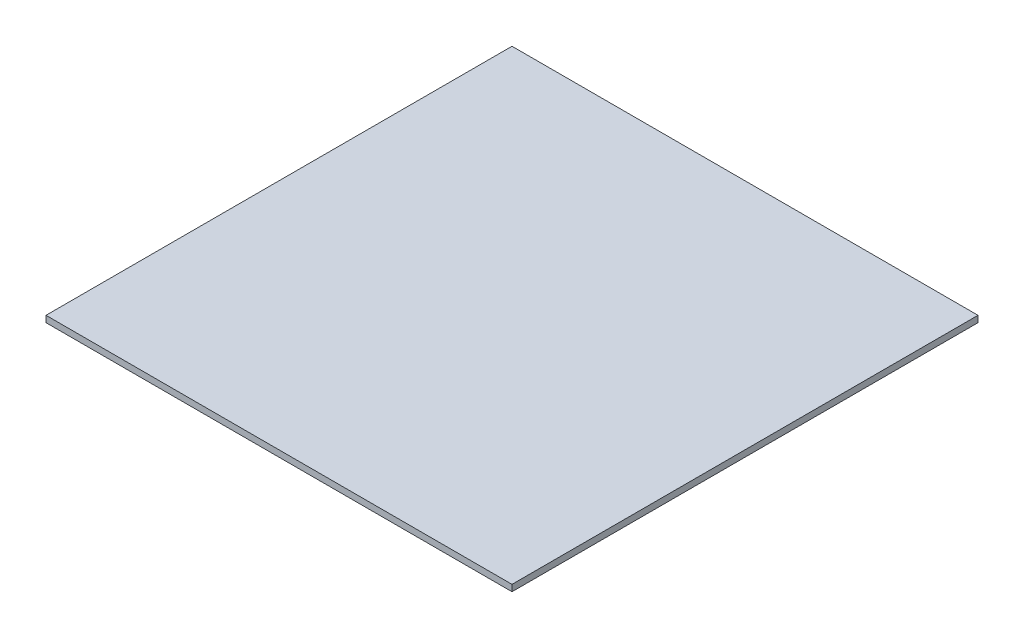
ISO-10303-21;
HEADER;
FILE_DESCRIPTION(('STEP AP214'),'2;1');
FILE_NAME('part.step','',(''),(''),'','','');
FILE_SCHEMA(('AUTOMOTIVE_DESIGN { 1 0 10303 214 1 1 1 1 }'));
ENDSEC;
DATA;
#1=APPLICATION_CONTEXT('core data for automotive mechanical design processes');
#2=APPLICATION_PROTOCOL_DEFINITION('international standard','automotive_design',2000,#1);
#3=PRODUCT_CONTEXT('',#1,'mechanical');
#4=PRODUCT('Part','Part','',(#3));
#5=PRODUCT_RELATED_PRODUCT_CATEGORY('part','',(#4));
#6=PRODUCT_DEFINITION_FORMATION('','',#4);
#7=PRODUCT_DEFINITION_CONTEXT('part definition',#1,'design');
#8=PRODUCT_DEFINITION('design','',#6,#7);
#9=PRODUCT_DEFINITION_SHAPE('','',#8);
#10=(LENGTH_UNIT() NAMED_UNIT(*) SI_UNIT(.MILLI.,.METRE.));
#11=(NAMED_UNIT(*) PLANE_ANGLE_UNIT() SI_UNIT($,.RADIAN.));
#12=(NAMED_UNIT(*) SI_UNIT($,.STERADIAN.) SOLID_ANGLE_UNIT());
#13=UNCERTAINTY_MEASURE_WITH_UNIT(LENGTH_MEASURE(1.E-05),#10,'distance_accuracy_value','');
#14=(GEOMETRIC_REPRESENTATION_CONTEXT(3) GLOBAL_UNCERTAINTY_ASSIGNED_CONTEXT((#13)) GLOBAL_UNIT_ASSIGNED_CONTEXT((#10,
#11,#12)) REPRESENTATION_CONTEXT('',''));
#15=CARTESIAN_POINT('',(0.,0.,0.));
#16=DIRECTION('',(0.,0.,1.));
#17=DIRECTION('',(1.,0.,0.));
#18=AXIS2_PLACEMENT_3D('',#15,#16,#17);
#19=CARTESIAN_POINT('',(-203.2,5.6,-203.2));
#20=DIRECTION('',(1.,0.,0.));
#21=DIRECTION('',(0.,0.,-1.));
#22=AXIS2_PLACEMENT_3D('',#19,#20,#21);
#23=PLANE('',#22);
#24=DIRECTION('',(0.,0.,1.));
#25=VECTOR('',#24,1.);
#26=CARTESIAN_POINT('',(-203.2,0.,-203.2));
#27=LINE('',#26,#25);
#28=CARTESIAN_POINT('',(-203.2,0.,-203.2));
#29=VERTEX_POINT('',#28);
#30=CARTESIAN_POINT('',(-203.2,0.,203.2));
#31=VERTEX_POINT('',#30);
#32=EDGE_CURVE('E111',#29,#31,#27,.T.);
#33=ORIENTED_EDGE('',*,*,#32,.T.);
#34=DIRECTION('',(0.,-1.,0.));
#35=VECTOR('',#34,1.);
#36=CARTESIAN_POINT('',(-203.2,5.6,203.2));
#37=LINE('',#36,#35);
#38=CARTESIAN_POINT('',(-203.2,5.6,203.2));
#39=VERTEX_POINT('',#38);
#40=EDGE_CURVE('E11',#39,#31,#37,.T.);
#41=ORIENTED_EDGE('',*,*,#40,.F.);
#42=DIRECTION('',(0.,0.,1.));
#43=VECTOR('',#42,1.);
#44=CARTESIAN_POINT('',(-203.2,5.6,-203.2));
#45=LINE('',#44,#43);
#46=CARTESIAN_POINT('',(-203.2,5.6,-203.2));
#47=VERTEX_POINT('',#46);
#48=EDGE_CURVE('E95',#47,#39,#45,.T.);
#49=ORIENTED_EDGE('',*,*,#48,.F.);
#50=DIRECTION('',(0.,-1.,0.));
#51=VECTOR('',#50,1.);
#52=CARTESIAN_POINT('',(-203.2,5.6,-203.2));
#53=LINE('',#52,#51);
#54=EDGE_CURVE('E107',#47,#29,#53,.T.);
#55=ORIENTED_EDGE('',*,*,#54,.T.);
#56=EDGE_LOOP('',(#33,#41,#49,#55));
#57=FACE_BOUND('',#56,.T.);
#58=ADVANCED_FACE('F43',(#57),#23,.F.);
#59=CARTESIAN_POINT('',(203.2,5.6,203.2));
#60=DIRECTION('',(0.,0.,-1.));
#61=DIRECTION('',(-1.,0.,0.));
#62=AXIS2_PLACEMENT_3D('',#59,#60,#61);
#63=PLANE('',#62);
#64=DIRECTION('',(1.,0.,0.));
#65=VECTOR('',#64,1.);
#66=CARTESIAN_POINT('',(203.2,0.,203.2));
#67=LINE('',#66,#65);
#68=CARTESIAN_POINT('',(203.2,0.,203.2));
#69=VERTEX_POINT('',#68);
#70=EDGE_CURVE('E100',#31,#69,#67,.T.);
#71=ORIENTED_EDGE('',*,*,#70,.T.);
#72=DIRECTION('',(0.,-1.,0.));
#73=VECTOR('',#72,1.);
#74=CARTESIAN_POINT('',(203.2,5.6,203.2));
#75=LINE('',#74,#73);
#76=CARTESIAN_POINT('',(203.2,5.6,203.2));
#77=VERTEX_POINT('',#76);
#78=EDGE_CURVE('E52',#77,#69,#75,.T.);
#79=ORIENTED_EDGE('',*,*,#78,.F.);
#80=DIRECTION('',(1.,0.,0.));
#81=VECTOR('',#80,1.);
#82=CARTESIAN_POINT('',(203.2,5.6,203.2));
#83=LINE('',#82,#81);
#84=EDGE_CURVE('E90',#39,#77,#83,.T.);
#85=ORIENTED_EDGE('',*,*,#84,.F.);
#86=ORIENTED_EDGE('',*,*,#40,.T.);
#87=EDGE_LOOP('',(#71,#79,#85,#86));
#88=FACE_BOUND('',#87,.T.);
#89=ADVANCED_FACE('F99',(#88),#63,.F.);
#90=CARTESIAN_POINT('',(203.2,5.6,-203.2));
#91=DIRECTION('',(-1.,0.,0.));
#92=DIRECTION('',(0.,0.,1.));
#93=AXIS2_PLACEMENT_3D('',#90,#91,#92);
#94=PLANE('',#93);
#95=DIRECTION('',(0.,0.,-1.));
#96=VECTOR('',#95,1.);
#97=CARTESIAN_POINT('',(203.2,0.,-203.2));
#98=LINE('',#97,#96);
#99=CARTESIAN_POINT('',(203.2,0.,-203.2));
#100=VERTEX_POINT('',#99);
#101=EDGE_CURVE('E77',#69,#100,#98,.T.);
#102=ORIENTED_EDGE('',*,*,#101,.T.);
#103=DIRECTION('',(0.,-1.,0.));
#104=VECTOR('',#103,1.);
#105=CARTESIAN_POINT('',(203.2,5.6,-203.2));
#106=LINE('',#105,#104);
#107=CARTESIAN_POINT('',(203.2,5.6,-203.2));
#108=VERTEX_POINT('',#107);
#109=EDGE_CURVE('E102',#108,#100,#106,.T.);
#110=ORIENTED_EDGE('',*,*,#109,.F.);
#111=DIRECTION('',(0.,0.,-1.));
#112=VECTOR('',#111,1.);
#113=CARTESIAN_POINT('',(203.2,5.6,-203.2));
#114=LINE('',#113,#112);
#115=EDGE_CURVE('E93',#77,#108,#114,.T.);
#116=ORIENTED_EDGE('',*,*,#115,.F.);
#117=ORIENTED_EDGE('',*,*,#78,.T.);
#118=EDGE_LOOP('',(#102,#110,#116,#117));
#119=FACE_BOUND('',#118,.T.);
#120=ADVANCED_FACE('F103',(#119),#94,.F.);
#121=CARTESIAN_POINT('',(203.2,5.6,-203.2));
#122=DIRECTION('',(0.,0.,1.));
#123=DIRECTION('',(1.,0.,0.));
#124=AXIS2_PLACEMENT_3D('',#121,#122,#123);
#125=PLANE('',#124);
#126=DIRECTION('',(-1.,0.,0.));
#127=VECTOR('',#126,1.);
#128=CARTESIAN_POINT('',(203.2,0.,-203.2));
#129=LINE('',#128,#127);
#130=EDGE_CURVE('E83',#100,#29,#129,.T.);
#131=ORIENTED_EDGE('',*,*,#130,.T.);
#132=ORIENTED_EDGE('',*,*,#54,.F.);
#133=DIRECTION('',(-1.,0.,0.));
#134=VECTOR('',#133,1.);
#135=CARTESIAN_POINT('',(203.2,5.6,-203.2));
#136=LINE('',#135,#134);
#137=EDGE_CURVE('E60',#108,#47,#136,.T.);
#138=ORIENTED_EDGE('',*,*,#137,.F.);
#139=ORIENTED_EDGE('',*,*,#109,.T.);
#140=EDGE_LOOP('',(#131,#132,#138,#139));
#141=FACE_BOUND('',#140,.T.);
#142=ADVANCED_FACE('F124',(#141),#125,.F.);
#143=CARTESIAN_POINT('',(0.,5.6,0.));
#144=DIRECTION('',(0.,-1.,0.));
#145=DIRECTION('',(0.,0.,-1.));
#146=AXIS2_PLACEMENT_3D('',#143,#144,#145);
#147=PLANE('',#146);
#148=ORIENTED_EDGE('',*,*,#48,.T.);
#149=ORIENTED_EDGE('',*,*,#84,.T.);
#150=ORIENTED_EDGE('',*,*,#115,.T.);
#151=ORIENTED_EDGE('',*,*,#137,.T.);
#152=EDGE_LOOP('',(#148,#149,#150,#151));
#153=FACE_BOUND('',#152,.T.);
#154=ADVANCED_FACE('F91',(#153),#147,.F.);
#155=CARTESIAN_POINT('',(0.,0.,0.));
#156=DIRECTION('',(0.,-1.,0.));
#157=DIRECTION('',(0.,0.,-1.));
#158=AXIS2_PLACEMENT_3D('',#155,#156,#157);
#159=PLANE('',#158);
#160=ORIENTED_EDGE('',*,*,#32,.F.);
#161=ORIENTED_EDGE('',*,*,#130,.F.);
#162=ORIENTED_EDGE('',*,*,#101,.F.);
#163=ORIENTED_EDGE('',*,*,#70,.F.);
#164=EDGE_LOOP('',(#160,#161,#162,#163));
#165=FACE_BOUND('',#164,.T.);
#166=ADVANCED_FACE('F127',(#165),#159,.T.);
#167=CLOSED_SHELL('',(#58,#89,#120,#142,#154,#166));
#168=MANIFOLD_SOLID_BREP('B2',#167);
#169=ADVANCED_BREP_SHAPE_REPRESENTATION('',(#18,#168),#14);
#170=SHAPE_DEFINITION_REPRESENTATION(#9,#169);
ENDSEC;
END-ISO-10303-21;
